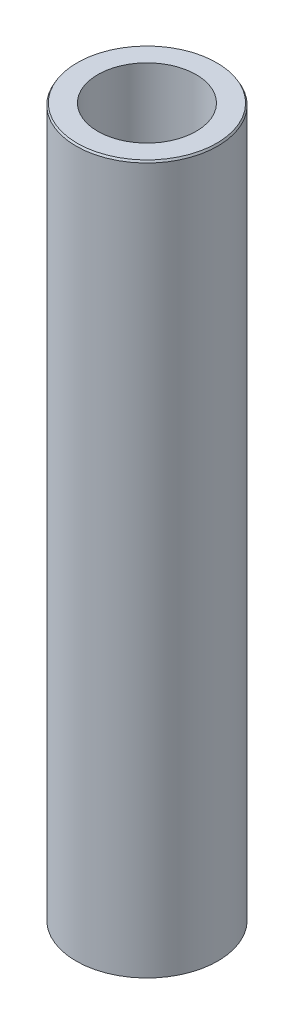
ISO-10303-21;
HEADER;
FILE_DESCRIPTION(('STEP AP214'),'2;1');
FILE_NAME('part.step','',(''),(''),'','','');
FILE_SCHEMA(('AUTOMOTIVE_DESIGN { 1 0 10303 214 1 1 1 1 }'));
ENDSEC;
DATA;
#1=APPLICATION_CONTEXT('core data for automotive mechanical design processes');
#2=APPLICATION_PROTOCOL_DEFINITION('international standard','automotive_design',2000,#1);
#3=PRODUCT_CONTEXT('',#1,'mechanical');
#4=PRODUCT('Part','Part','',(#3));
#5=PRODUCT_RELATED_PRODUCT_CATEGORY('part','',(#4));
#6=PRODUCT_DEFINITION_FORMATION('','',#4);
#7=PRODUCT_DEFINITION_CONTEXT('part definition',#1,'design');
#8=PRODUCT_DEFINITION('design','',#6,#7);
#9=PRODUCT_DEFINITION_SHAPE('','',#8);
#10=(LENGTH_UNIT() NAMED_UNIT(*) SI_UNIT(.MILLI.,.METRE.));
#11=(NAMED_UNIT(*) PLANE_ANGLE_UNIT() SI_UNIT($,.RADIAN.));
#12=(NAMED_UNIT(*) SI_UNIT($,.STERADIAN.) SOLID_ANGLE_UNIT());
#13=UNCERTAINTY_MEASURE_WITH_UNIT(LENGTH_MEASURE(1.E-05),#10,'distance_accuracy_value','');
#14=(GEOMETRIC_REPRESENTATION_CONTEXT(3) GLOBAL_UNCERTAINTY_ASSIGNED_CONTEXT((#13)) GLOBAL_UNIT_ASSIGNED_CONTEXT((#10,
#11,#12)) REPRESENTATION_CONTEXT('',''));
#15=CARTESIAN_POINT('',(0.,0.,0.));
#16=DIRECTION('',(0.,0.,1.));
#17=DIRECTION('',(1.,0.,0.));
#18=AXIS2_PLACEMENT_3D('',#15,#16,#17);
#19=CARTESIAN_POINT('',(0.,600.,0.));
#20=DIRECTION('',(0.,-1.,0.));
#21=DIRECTION('',(0.,0.,-1.));
#22=AXIS2_PLACEMENT_3D('',#19,#20,#21);
#23=CYLINDRICAL_SURFACE('',#22,60.);
#24=CARTESIAN_POINT('',(0.,598.384890250445,0.));
#25=DIRECTION('',(0.,1.,0.));
#26=DIRECTION('',(0.,0.,1.));
#27=AXIS2_PLACEMENT_3D('',#24,#25,#26);
#28=CIRCLE('',#27,60.);
#29=CARTESIAN_POINT('',(0.,598.384890250445,60.));
#30=VERTEX_POINT('',#29);
#31=EDGE_CURVE('E50',#30,#30,#28,.F.);
#32=ORIENTED_EDGE('',*,*,#31,.T.);
#33=EDGE_LOOP('',(#32));
#34=FACE_BOUND('',#33,.T.);
#35=CARTESIAN_POINT('',(0.,0.932484048676296,0.));
#36=DIRECTION('',(0.,1.,0.));
#37=DIRECTION('',(0.,0.,1.));
#38=AXIS2_PLACEMENT_3D('',#35,#36,#37);
#39=CIRCLE('',#38,60.);
#40=CARTESIAN_POINT('',(0.,0.932484048676296,60.));
#41=VERTEX_POINT('',#40);
#42=EDGE_CURVE('E51',#41,#41,#39,.T.);
#43=ORIENTED_EDGE('',*,*,#42,.T.);
#44=EDGE_LOOP('',(#43));
#45=FACE_BOUND('',#44,.T.);
#46=ADVANCED_FACE('F39',(#34,#45),#23,.T.);
#47=CARTESIAN_POINT('',(0.,600.,0.));
#48=DIRECTION('',(0.,1.,0.));
#49=DIRECTION('',(0.,0.,1.));
#50=AXIS2_PLACEMENT_3D('',#47,#48,#49);
#51=PLANE('',#50);
#52=CARTESIAN_POINT('',(0.,600.,0.));
#53=DIRECTION('',(0.,1.,0.));
#54=DIRECTION('',(0.,0.,1.));
#55=AXIS2_PLACEMENT_3D('',#52,#53,#54);
#56=CIRCLE('',#55,59.0675159513237);
#57=CARTESIAN_POINT('',(0.,600.,59.0675159513237));
#58=VERTEX_POINT('',#57);
#59=EDGE_CURVE('E54',#58,#58,#56,.T.);
#60=ORIENTED_EDGE('',*,*,#59,.T.);
#61=EDGE_LOOP('',(#60));
#62=FACE_BOUND('',#61,.T.);
#63=CARTESIAN_POINT('',(0.,600.,0.));
#64=DIRECTION('',(0.,1.,0.));
#65=DIRECTION('',(0.,0.,1.));
#66=AXIS2_PLACEMENT_3D('',#63,#64,#65);
#67=CIRCLE('',#66,41.6331279170696);
#68=CARTESIAN_POINT('',(0.,600.,41.6331279170696));
#69=VERTEX_POINT('',#68);
#70=EDGE_CURVE('E58',#69,#69,#67,.T.);
#71=ORIENTED_EDGE('',*,*,#70,.F.);
#72=EDGE_LOOP('',(#71));
#73=FACE_BOUND('',#72,.T.);
#74=ADVANCED_FACE('F69',(#62,#73),#51,.T.);
#75=CARTESIAN_POINT('',(0.,0.,0.));
#76=DIRECTION('',(0.,1.,0.));
#77=DIRECTION('',(0.,0.,1.));
#78=AXIS2_PLACEMENT_3D('',#75,#76,#77);
#79=PLANE('',#78);
#80=CARTESIAN_POINT('',(0.,0.,0.));
#81=DIRECTION('',(0.,1.,0.));
#82=DIRECTION('',(0.,0.,1.));
#83=AXIS2_PLACEMENT_3D('',#80,#81,#82);
#84=CIRCLE('',#83,58.3848902504451);
#85=CARTESIAN_POINT('',(0.,0.,58.3848902504451));
#86=VERTEX_POINT('',#85);
#87=EDGE_CURVE('E10',#86,#86,#84,.F.);
#88=ORIENTED_EDGE('',*,*,#87,.T.);
#89=EDGE_LOOP('',(#88));
#90=FACE_BOUND('',#89,.T.);
#91=CARTESIAN_POINT('',(0.,0.,0.));
#92=DIRECTION('',(0.,1.,0.));
#93=DIRECTION('',(0.,0.,1.));
#94=AXIS2_PLACEMENT_3D('',#91,#92,#93);
#95=CIRCLE('',#94,41.6331279170696);
#96=CARTESIAN_POINT('',(0.,0.,41.6331279170696));
#97=VERTEX_POINT('',#96);
#98=EDGE_CURVE('E63',#97,#97,#95,.T.);
#99=ORIENTED_EDGE('',*,*,#98,.T.);
#100=EDGE_LOOP('',(#99));
#101=FACE_BOUND('',#100,.T.);
#102=ADVANCED_FACE('F75',(#90,#101),#79,.F.);
#103=CARTESIAN_POINT('',(0.,600.,0.));
#104=DIRECTION('',(0.,-1.,0.));
#105=DIRECTION('',(0.,0.,-1.));
#106=AXIS2_PLACEMENT_3D('',#103,#104,#105);
#107=CYLINDRICAL_SURFACE('',#106,41.6331279170696);
#108=ORIENTED_EDGE('',*,*,#70,.T.);
#109=EDGE_LOOP('',(#108));
#110=FACE_BOUND('',#109,.T.);
#111=ORIENTED_EDGE('',*,*,#98,.F.);
#112=EDGE_LOOP('',(#111));
#113=FACE_BOUND('',#112,.T.);
#114=ADVANCED_FACE('F70',(#110,#113),#107,.F.);
#115=CARTESIAN_POINT('',(0.,600.,0.));
#116=DIRECTION('',(0.,-1.,0.));
#117=DIRECTION('',(0.,0.,-1.));
#118=AXIS2_PLACEMENT_3D('',#115,#116,#117);
#119=CONICAL_SURFACE('',#118,59.0675159513237,0.523598775598286);
#120=ORIENTED_EDGE('',*,*,#31,.F.);
#121=EDGE_LOOP('',(#120));
#122=FACE_BOUND('',#121,.T.);
#123=ORIENTED_EDGE('',*,*,#59,.F.);
#124=EDGE_LOOP('',(#123));
#125=FACE_BOUND('',#124,.T.);
#126=ADVANCED_FACE('F81',(#122,#125),#119,.T.);
#127=CARTESIAN_POINT('',(0.,0.932484048676296,0.));
#128=DIRECTION('',(0.,1.,0.));
#129=DIRECTION('',(0.,0.,1.));
#130=AXIS2_PLACEMENT_3D('',#127,#128,#129);
#131=CONICAL_SURFACE('',#130,60.,1.04719755119661);
#132=ORIENTED_EDGE('',*,*,#87,.F.);
#133=EDGE_LOOP('',(#132));
#134=FACE_BOUND('',#133,.T.);
#135=ORIENTED_EDGE('',*,*,#42,.F.);
#136=EDGE_LOOP('',(#135));
#137=FACE_BOUND('',#136,.T.);
#138=ADVANCED_FACE('F45',(#134,#137),#131,.T.);
#139=CLOSED_SHELL('',(#46,#74,#102,#114,#126,#138));
#140=MANIFOLD_SOLID_BREP('B2',#139);
#141=ADVANCED_BREP_SHAPE_REPRESENTATION('',(#18,#140),#14);
#142=SHAPE_DEFINITION_REPRESENTATION(#9,#141);
ENDSEC;
END-ISO-10303-21;
